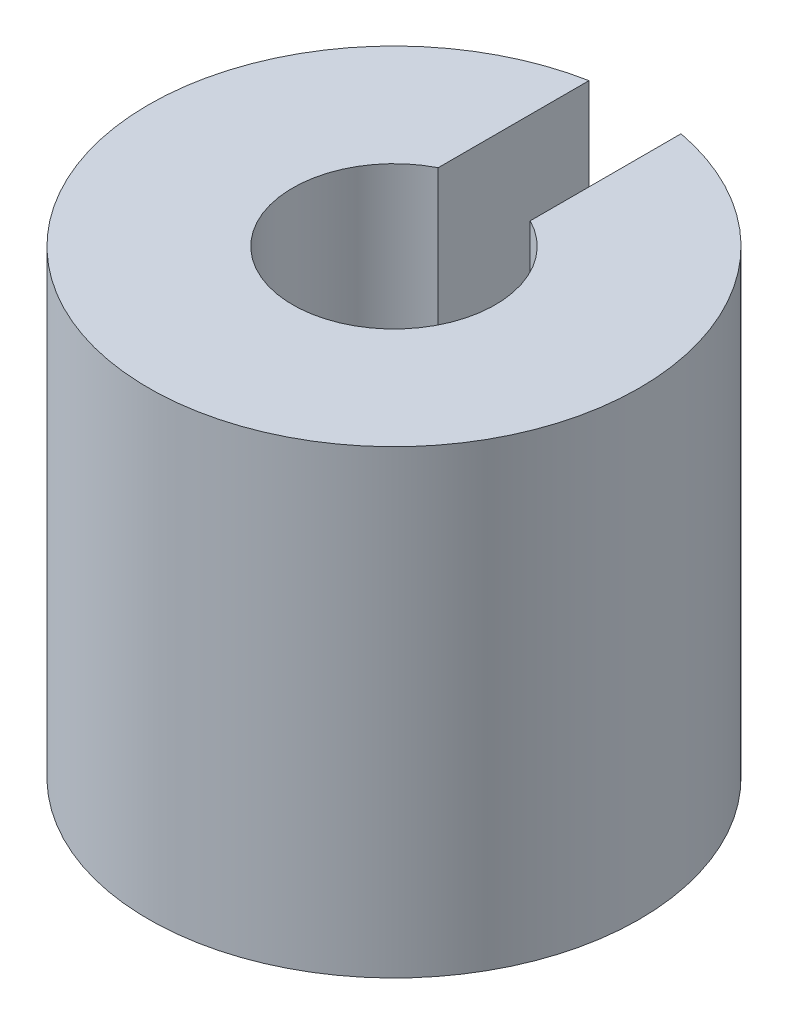
ISO-10303-21;
HEADER;
FILE_DESCRIPTION(('STEP AP214'),'2;1');
FILE_NAME('part.step','',(''),(''),'','','');
FILE_SCHEMA(('AUTOMOTIVE_DESIGN { 1 0 10303 214 1 1 1 1 }'));
ENDSEC;
DATA;
#1=APPLICATION_CONTEXT('core data for automotive mechanical design processes');
#2=APPLICATION_PROTOCOL_DEFINITION('international standard','automotive_design',2000,#1);
#3=PRODUCT_CONTEXT('',#1,'mechanical');
#4=PRODUCT('Part','Part','',(#3));
#5=PRODUCT_RELATED_PRODUCT_CATEGORY('part','',(#4));
#6=PRODUCT_DEFINITION_FORMATION('','',#4);
#7=PRODUCT_DEFINITION_CONTEXT('part definition',#1,'design');
#8=PRODUCT_DEFINITION('design','',#6,#7);
#9=PRODUCT_DEFINITION_SHAPE('','',#8);
#10=(LENGTH_UNIT() NAMED_UNIT(*) SI_UNIT(.MILLI.,.METRE.));
#11=(NAMED_UNIT(*) PLANE_ANGLE_UNIT() SI_UNIT($,.RADIAN.));
#12=(NAMED_UNIT(*) SI_UNIT($,.STERADIAN.) SOLID_ANGLE_UNIT());
#13=UNCERTAINTY_MEASURE_WITH_UNIT(LENGTH_MEASURE(1.E-05),#10,'distance_accuracy_value','');
#14=(GEOMETRIC_REPRESENTATION_CONTEXT(3) GLOBAL_UNCERTAINTY_ASSIGNED_CONTEXT((#13)) GLOBAL_UNIT_ASSIGNED_CONTEXT((#10,
#11,#12)) REPRESENTATION_CONTEXT('',''));
#15=CARTESIAN_POINT('',(0.,0.,0.));
#16=DIRECTION('',(0.,0.,1.));
#17=DIRECTION('',(1.,0.,0.));
#18=AXIS2_PLACEMENT_3D('',#15,#16,#17);
#19=CARTESIAN_POINT('',(0.,3.75,0.));
#20=DIRECTION('',(0.,-1.,0.));
#21=DIRECTION('',(0.,0.,-1.));
#22=AXIS2_PLACEMENT_3D('',#19,#20,#21);
#23=CYLINDRICAL_SURFACE('',#22,1.651);
#24=DIRECTION('',(0.,1.,0.));
#25=VECTOR('',#24,1.);
#26=CARTESIAN_POINT('',(-0.75,3.75,-1.47081643994076));
#27=LINE('',#26,#25);
#28=CARTESIAN_POINT('',(-0.75,-3.75,-1.47081643994076));
#29=VERTEX_POINT('',#28);
#30=CARTESIAN_POINT('',(-0.75,3.75,-1.47081643994076));
#31=VERTEX_POINT('',#30);
#32=EDGE_CURVE('E81',#29,#31,#27,.T.);
#33=ORIENTED_EDGE('',*,*,#32,.T.);
#34=CARTESIAN_POINT('',(0.,3.75,0.));
#35=DIRECTION('',(0.,-1.,0.));
#36=DIRECTION('',(0.,0.,-1.));
#37=AXIS2_PLACEMENT_3D('',#34,#35,#36);
#38=CIRCLE('',#37,1.651);
#39=CARTESIAN_POINT('',(0.75,3.75,-1.47081643994076));
#40=VERTEX_POINT('',#39);
#41=EDGE_CURVE('E59',#40,#31,#38,.T.);
#42=ORIENTED_EDGE('',*,*,#41,.F.);
#43=DIRECTION('',(0.,1.,0.));
#44=VECTOR('',#43,1.);
#45=CARTESIAN_POINT('',(0.75,3.75,-1.47081643994076));
#46=LINE('',#45,#44);
#47=CARTESIAN_POINT('',(0.75,-3.75,-1.47081643994076));
#48=VERTEX_POINT('',#47);
#49=EDGE_CURVE('E56',#40,#48,#46,.F.);
#50=ORIENTED_EDGE('',*,*,#49,.T.);
#51=CARTESIAN_POINT('',(0.,-3.75,0.));
#52=DIRECTION('',(0.,-1.,0.));
#53=DIRECTION('',(0.,0.,-1.));
#54=AXIS2_PLACEMENT_3D('',#51,#52,#53);
#55=CIRCLE('',#54,1.651);
#56=EDGE_CURVE('E20',#48,#29,#55,.T.);
#57=ORIENTED_EDGE('',*,*,#56,.T.);
#58=EDGE_LOOP('',(#33,#42,#50,#57));
#59=FACE_BOUND('',#58,.T.);
#60=ADVANCED_FACE('F17',(#59),#23,.F.);
#61=CARTESIAN_POINT('',(0.,-3.75,0.));
#62=DIRECTION('',(0.,1.,0.));
#63=DIRECTION('',(0.,0.,1.));
#64=AXIS2_PLACEMENT_3D('',#61,#62,#63);
#65=PLANE('',#64);
#66=DIRECTION('',(0.,0.,-1.));
#67=VECTOR('',#66,1.);
#68=CARTESIAN_POINT('',(0.75,-3.75,-1.47081643994076));
#69=LINE('',#68,#67);
#70=CARTESIAN_POINT('',(0.75,-3.75,-3.92905841137543));
#71=VERTEX_POINT('',#70);
#72=EDGE_CURVE('E63',#48,#71,#69,.T.);
#73=ORIENTED_EDGE('',*,*,#72,.T.);
#74=CARTESIAN_POINT('',(0.,-3.75,0.));
#75=DIRECTION('',(0.,-1.,0.));
#76=DIRECTION('',(0.,0.,-1.));
#77=AXIS2_PLACEMENT_3D('',#74,#75,#76);
#78=CIRCLE('',#77,4.);
#79=CARTESIAN_POINT('',(-0.749999999999999,-3.75,-3.92905841137543));
#80=VERTEX_POINT('',#79);
#81=EDGE_CURVE('E80',#80,#71,#78,.F.);
#82=ORIENTED_EDGE('',*,*,#81,.F.);
#83=DIRECTION('',(0.,0.,1.));
#84=VECTOR('',#83,1.);
#85=CARTESIAN_POINT('',(-0.75,-3.75,-1.47081643994076));
#86=LINE('',#85,#84);
#87=EDGE_CURVE('E69',#80,#29,#86,.T.);
#88=ORIENTED_EDGE('',*,*,#87,.T.);
#89=ORIENTED_EDGE('',*,*,#56,.F.);
#90=EDGE_LOOP('',(#73,#82,#88,#89));
#91=FACE_BOUND('',#90,.T.);
#92=ADVANCED_FACE('F66',(#91),#65,.F.);
#93=CARTESIAN_POINT('',(0.75,3.75,-1.47081643994076));
#94=DIRECTION('',(1.,0.,0.));
#95=DIRECTION('',(0.,0.,-1.));
#96=AXIS2_PLACEMENT_3D('',#93,#94,#95);
#97=PLANE('',#96);
#98=ORIENTED_EDGE('',*,*,#49,.F.);
#99=DIRECTION('',(0.,0.,1.));
#100=VECTOR('',#99,1.);
#101=CARTESIAN_POINT('',(0.75,3.75,0.));
#102=LINE('',#101,#100);
#103=CARTESIAN_POINT('',(0.75,3.75,-3.92905841137543));
#104=VERTEX_POINT('',#103);
#105=EDGE_CURVE('E76',#104,#40,#102,.T.);
#106=ORIENTED_EDGE('',*,*,#105,.F.);
#107=DIRECTION('',(0.,-1.,0.));
#108=VECTOR('',#107,1.);
#109=CARTESIAN_POINT('',(0.75,3.75,-3.92905841137543));
#110=LINE('',#109,#108);
#111=EDGE_CURVE('E73',#71,#104,#110,.F.);
#112=ORIENTED_EDGE('',*,*,#111,.F.);
#113=ORIENTED_EDGE('',*,*,#72,.F.);
#114=EDGE_LOOP('',(#98,#106,#112,#113));
#115=FACE_BOUND('',#114,.T.);
#116=ADVANCED_FACE('F71',(#115),#97,.F.);
#117=CARTESIAN_POINT('',(0.,3.75,0.));
#118=DIRECTION('',(0.,1.,0.));
#119=DIRECTION('',(0.,0.,1.));
#120=AXIS2_PLACEMENT_3D('',#117,#118,#119);
#121=PLANE('',#120);
#122=CARTESIAN_POINT('',(0.,3.75,0.));
#123=DIRECTION('',(0.,-1.,0.));
#124=DIRECTION('',(0.,0.,-1.));
#125=AXIS2_PLACEMENT_3D('',#122,#123,#124);
#126=CIRCLE('',#125,4.);
#127=CARTESIAN_POINT('',(-0.749999999999999,3.75,-3.92905841137543));
#128=VERTEX_POINT('',#127);
#129=EDGE_CURVE('E26',#104,#128,#126,.T.);
#130=ORIENTED_EDGE('',*,*,#129,.F.);
#131=ORIENTED_EDGE('',*,*,#105,.T.);
#132=ORIENTED_EDGE('',*,*,#41,.T.);
#133=DIRECTION('',(0.,0.,1.));
#134=VECTOR('',#133,1.);
#135=CARTESIAN_POINT('',(-0.75,3.75,-1.47081643994076));
#136=LINE('',#135,#134);
#137=EDGE_CURVE('E35',#31,#128,#136,.F.);
#138=ORIENTED_EDGE('',*,*,#137,.T.);
#139=EDGE_LOOP('',(#130,#131,#132,#138));
#140=FACE_BOUND('',#139,.T.);
#141=ADVANCED_FACE('F88',(#140),#121,.T.);
#142=CARTESIAN_POINT('',(-0.75,3.75,-1.47081643994076));
#143=DIRECTION('',(-1.,0.,0.));
#144=DIRECTION('',(0.,0.,1.));
#145=AXIS2_PLACEMENT_3D('',#142,#143,#144);
#146=PLANE('',#145);
#147=DIRECTION('',(0.,-1.,0.));
#148=VECTOR('',#147,1.);
#149=CARTESIAN_POINT('',(-0.749999999999998,3.75,-3.92905841137543));
#150=LINE('',#149,#148);
#151=EDGE_CURVE('E11',#128,#80,#150,.T.);
#152=ORIENTED_EDGE('',*,*,#151,.F.);
#153=ORIENTED_EDGE('',*,*,#137,.F.);
#154=ORIENTED_EDGE('',*,*,#32,.F.);
#155=ORIENTED_EDGE('',*,*,#87,.F.);
#156=EDGE_LOOP('',(#152,#153,#154,#155));
#157=FACE_BOUND('',#156,.T.);
#158=ADVANCED_FACE('F91',(#157),#146,.F.);
#159=CARTESIAN_POINT('',(0.,3.75,0.));
#160=DIRECTION('',(0.,-1.,0.));
#161=DIRECTION('',(0.,0.,-1.));
#162=AXIS2_PLACEMENT_3D('',#159,#160,#161);
#163=CYLINDRICAL_SURFACE('',#162,4.);
#164=ORIENTED_EDGE('',*,*,#129,.T.);
#165=ORIENTED_EDGE('',*,*,#151,.T.);
#166=ORIENTED_EDGE('',*,*,#81,.T.);
#167=ORIENTED_EDGE('',*,*,#111,.T.);
#168=EDGE_LOOP('',(#164,#165,#166,#167));
#169=FACE_BOUND('',#168,.T.);
#170=ADVANCED_FACE('F89',(#169),#163,.T.);
#171=CLOSED_SHELL('',(#60,#92,#116,#141,#158,#170));
#172=MANIFOLD_SOLID_BREP('B1',#171);
#173=ADVANCED_BREP_SHAPE_REPRESENTATION('',(#18,#172),#14);
#174=SHAPE_DEFINITION_REPRESENTATION(#9,#173);
ENDSEC;
END-ISO-10303-21;
